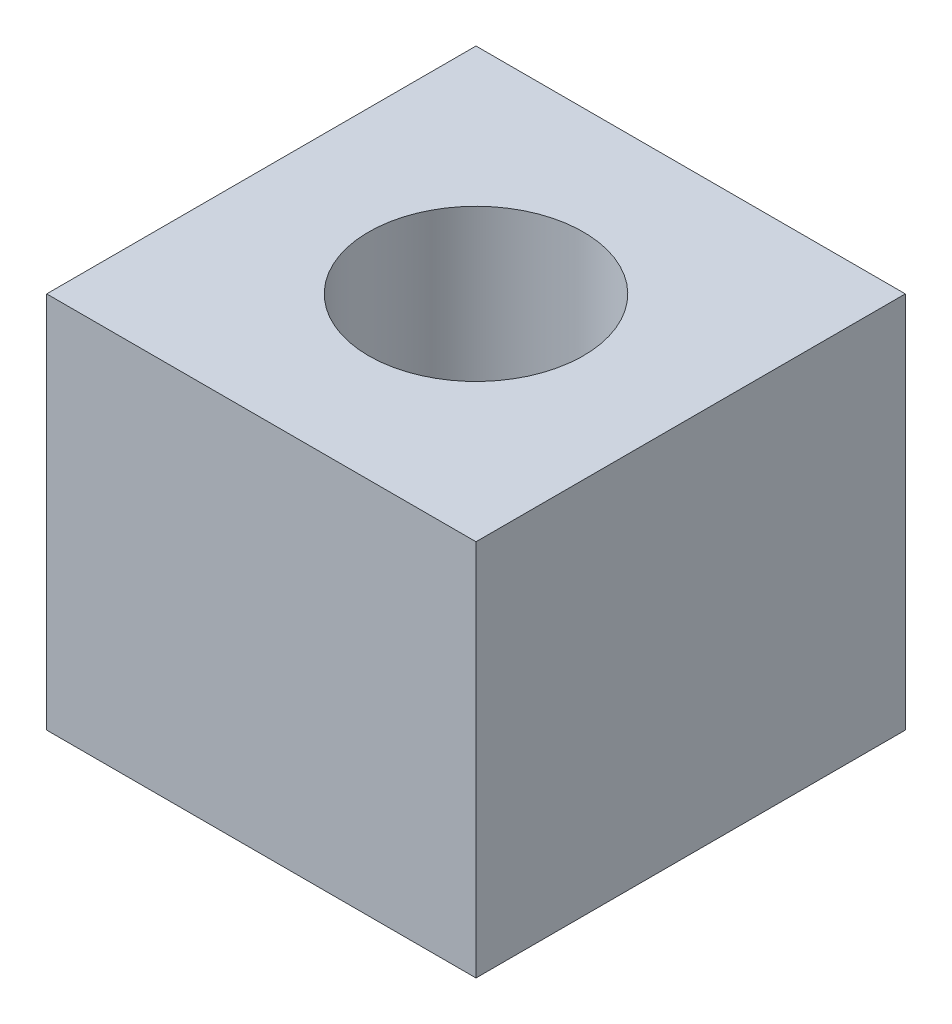
ISO-10303-21;
HEADER;
FILE_DESCRIPTION(('STEP AP214'),'2;1');
FILE_NAME('part.step','',(''),(''),'','','');
FILE_SCHEMA(('AUTOMOTIVE_DESIGN { 1 0 10303 214 1 1 1 1 }'));
ENDSEC;
DATA;
#1=APPLICATION_CONTEXT('core data for automotive mechanical design processes');
#2=APPLICATION_PROTOCOL_DEFINITION('international standard','automotive_design',2000,#1);
#3=PRODUCT_CONTEXT('',#1,'mechanical');
#4=PRODUCT('Part','Part','',(#3));
#5=PRODUCT_RELATED_PRODUCT_CATEGORY('part','',(#4));
#6=PRODUCT_DEFINITION_FORMATION('','',#4);
#7=PRODUCT_DEFINITION_CONTEXT('part definition',#1,'design');
#8=PRODUCT_DEFINITION('design','',#6,#7);
#9=PRODUCT_DEFINITION_SHAPE('','',#8);
#10=(LENGTH_UNIT() NAMED_UNIT(*) SI_UNIT(.MILLI.,.METRE.));
#11=(NAMED_UNIT(*) PLANE_ANGLE_UNIT() SI_UNIT($,.RADIAN.));
#12=(NAMED_UNIT(*) SI_UNIT($,.STERADIAN.) SOLID_ANGLE_UNIT());
#13=UNCERTAINTY_MEASURE_WITH_UNIT(LENGTH_MEASURE(1.E-05),#10,'distance_accuracy_value','');
#14=(GEOMETRIC_REPRESENTATION_CONTEXT(3) GLOBAL_UNCERTAINTY_ASSIGNED_CONTEXT((#13)) GLOBAL_UNIT_ASSIGNED_CONTEXT((#10,
#11,#12)) REPRESENTATION_CONTEXT('',''));
#15=CARTESIAN_POINT('',(0.,0.,0.));
#16=DIRECTION('',(0.,0.,1.));
#17=DIRECTION('',(1.,0.,0.));
#18=AXIS2_PLACEMENT_3D('',#15,#16,#17);
#19=CARTESIAN_POINT('',(-12.7,22.352,12.7));
#20=DIRECTION('',(1.,0.,0.));
#21=DIRECTION('',(0.,0.,-1.));
#22=AXIS2_PLACEMENT_3D('',#19,#20,#21);
#23=PLANE('',#22);
#24=DIRECTION('',(0.,0.,1.));
#25=VECTOR('',#24,1.);
#26=CARTESIAN_POINT('',(-12.7,0.,12.7));
#27=LINE('',#26,#25);
#28=CARTESIAN_POINT('',(-12.7,0.,-12.7));
#29=VERTEX_POINT('',#28);
#30=CARTESIAN_POINT('',(-12.7,0.,12.7));
#31=VERTEX_POINT('',#30);
#32=EDGE_CURVE('E99',#29,#31,#27,.T.);
#33=ORIENTED_EDGE('',*,*,#32,.T.);
#34=DIRECTION('',(0.,-1.,0.));
#35=VECTOR('',#34,1.);
#36=CARTESIAN_POINT('',(-12.7,22.352,12.7));
#37=LINE('',#36,#35);
#38=CARTESIAN_POINT('',(-12.7,22.352,12.7));
#39=VERTEX_POINT('',#38);
#40=EDGE_CURVE('E11',#39,#31,#37,.T.);
#41=ORIENTED_EDGE('',*,*,#40,.F.);
#42=DIRECTION('',(0.,0.,1.));
#43=VECTOR('',#42,1.);
#44=CARTESIAN_POINT('',(-12.7,22.352,12.7));
#45=LINE('',#44,#43);
#46=CARTESIAN_POINT('',(-12.7,22.352,-12.7));
#47=VERTEX_POINT('',#46);
#48=EDGE_CURVE('E86',#47,#39,#45,.T.);
#49=ORIENTED_EDGE('',*,*,#48,.F.);
#50=DIRECTION('',(0.,-1.,0.));
#51=VECTOR('',#50,1.);
#52=CARTESIAN_POINT('',(-12.7,22.352,-12.7));
#53=LINE('',#52,#51);
#54=EDGE_CURVE('E95',#47,#29,#53,.T.);
#55=ORIENTED_EDGE('',*,*,#54,.T.);
#56=EDGE_LOOP('',(#33,#41,#49,#55));
#57=FACE_BOUND('',#56,.T.);
#58=ADVANCED_FACE('F34',(#57),#23,.F.);
#59=CARTESIAN_POINT('',(12.7,22.352,12.7));
#60=DIRECTION('',(0.,0.,-1.));
#61=DIRECTION('',(-1.,0.,0.));
#62=AXIS2_PLACEMENT_3D('',#59,#60,#61);
#63=PLANE('',#62);
#64=DIRECTION('',(1.,0.,0.));
#65=VECTOR('',#64,1.);
#66=CARTESIAN_POINT('',(12.7,0.,12.7));
#67=LINE('',#66,#65);
#68=CARTESIAN_POINT('',(12.7,0.,12.7));
#69=VERTEX_POINT('',#68);
#70=EDGE_CURVE('E90',#31,#69,#67,.T.);
#71=ORIENTED_EDGE('',*,*,#70,.T.);
#72=DIRECTION('',(0.,-1.,0.));
#73=VECTOR('',#72,1.);
#74=CARTESIAN_POINT('',(12.7,22.352,12.7));
#75=LINE('',#74,#73);
#76=CARTESIAN_POINT('',(12.7,22.352,12.7));
#77=VERTEX_POINT('',#76);
#78=EDGE_CURVE('E43',#77,#69,#75,.T.);
#79=ORIENTED_EDGE('',*,*,#78,.F.);
#80=DIRECTION('',(1.,0.,0.));
#81=VECTOR('',#80,1.);
#82=CARTESIAN_POINT('',(12.7,22.352,12.7));
#83=LINE('',#82,#81);
#84=EDGE_CURVE('E81',#39,#77,#83,.T.);
#85=ORIENTED_EDGE('',*,*,#84,.F.);
#86=ORIENTED_EDGE('',*,*,#40,.T.);
#87=EDGE_LOOP('',(#71,#79,#85,#86));
#88=FACE_BOUND('',#87,.T.);
#89=ADVANCED_FACE('F89',(#88),#63,.F.);
#90=CARTESIAN_POINT('',(12.7,22.352,12.7));
#91=DIRECTION('',(-1.,0.,0.));
#92=DIRECTION('',(0.,0.,1.));
#93=AXIS2_PLACEMENT_3D('',#90,#91,#92);
#94=PLANE('',#93);
#95=DIRECTION('',(0.,0.,-1.));
#96=VECTOR('',#95,1.);
#97=CARTESIAN_POINT('',(12.7,0.,12.7));
#98=LINE('',#97,#96);
#99=CARTESIAN_POINT('',(12.7,0.,-12.7));
#100=VERTEX_POINT('',#99);
#101=EDGE_CURVE('E68',#69,#100,#98,.T.);
#102=ORIENTED_EDGE('',*,*,#101,.T.);
#103=DIRECTION('',(0.,-1.,0.));
#104=VECTOR('',#103,1.);
#105=CARTESIAN_POINT('',(12.7,22.352,-12.7));
#106=LINE('',#105,#104);
#107=CARTESIAN_POINT('',(12.7,22.352,-12.7));
#108=VERTEX_POINT('',#107);
#109=EDGE_CURVE('E91',#108,#100,#106,.T.);
#110=ORIENTED_EDGE('',*,*,#109,.F.);
#111=DIRECTION('',(0.,0.,-1.));
#112=VECTOR('',#111,1.);
#113=CARTESIAN_POINT('',(12.7,22.352,12.7));
#114=LINE('',#113,#112);
#115=EDGE_CURVE('E84',#77,#108,#114,.T.);
#116=ORIENTED_EDGE('',*,*,#115,.F.);
#117=ORIENTED_EDGE('',*,*,#78,.T.);
#118=EDGE_LOOP('',(#102,#110,#116,#117));
#119=FACE_BOUND('',#118,.T.);
#120=ADVANCED_FACE('F93',(#119),#94,.F.);
#121=CARTESIAN_POINT('',(12.7,22.352,-12.7));
#122=DIRECTION('',(0.,0.,1.));
#123=DIRECTION('',(1.,0.,0.));
#124=AXIS2_PLACEMENT_3D('',#121,#122,#123);
#125=PLANE('',#124);
#126=DIRECTION('',(-1.,0.,0.));
#127=VECTOR('',#126,1.);
#128=CARTESIAN_POINT('',(12.7,0.,-12.7));
#129=LINE('',#128,#127);
#130=EDGE_CURVE('E74',#100,#29,#129,.T.);
#131=ORIENTED_EDGE('',*,*,#130,.T.);
#132=ORIENTED_EDGE('',*,*,#54,.F.);
#133=DIRECTION('',(-1.,0.,0.));
#134=VECTOR('',#133,1.);
#135=CARTESIAN_POINT('',(12.7,22.352,-12.7));
#136=LINE('',#135,#134);
#137=EDGE_CURVE('E51',#108,#47,#136,.T.);
#138=ORIENTED_EDGE('',*,*,#137,.F.);
#139=ORIENTED_EDGE('',*,*,#109,.T.);
#140=EDGE_LOOP('',(#131,#132,#138,#139));
#141=FACE_BOUND('',#140,.T.);
#142=ADVANCED_FACE('F106',(#141),#125,.F.);
#143=CARTESIAN_POINT('',(0.,22.352,0.));
#144=DIRECTION('',(0.,1.,0.));
#145=DIRECTION('',(0.,0.,1.));
#146=AXIS2_PLACEMENT_3D('',#143,#144,#145);
#147=PLANE('',#146);
#148=CARTESIAN_POINT('',(0.,22.352,0.));
#149=DIRECTION('',(0.,1.,0.));
#150=DIRECTION('',(0.,0.,1.));
#151=AXIS2_PLACEMENT_3D('',#148,#149,#150);
#152=CIRCLE('',#151,6.35);
#153=CARTESIAN_POINT('',(0.,22.352,6.35));
#154=VERTEX_POINT('',#153);
#155=EDGE_CURVE('E112',#154,#154,#152,.T.);
#156=ORIENTED_EDGE('',*,*,#155,.F.);
#157=EDGE_LOOP('',(#156));
#158=FACE_BOUND('',#157,.T.);
#159=ORIENTED_EDGE('',*,*,#48,.T.);
#160=ORIENTED_EDGE('',*,*,#84,.T.);
#161=ORIENTED_EDGE('',*,*,#115,.T.);
#162=ORIENTED_EDGE('',*,*,#137,.T.);
#163=EDGE_LOOP('',(#159,#160,#161,#162));
#164=FACE_BOUND('',#163,.T.);
#165=ADVANCED_FACE('F82',(#158,#164),#147,.T.);
#166=CARTESIAN_POINT('',(0.,0.,0.));
#167=DIRECTION('',(0.,1.,0.));
#168=DIRECTION('',(0.,0.,1.));
#169=AXIS2_PLACEMENT_3D('',#166,#167,#168);
#170=PLANE('',#169);
#171=CARTESIAN_POINT('',(0.,0.,0.));
#172=DIRECTION('',(0.,1.,0.));
#173=DIRECTION('',(0.,0.,1.));
#174=AXIS2_PLACEMENT_3D('',#171,#172,#173);
#175=CIRCLE('',#174,6.35);
#176=CARTESIAN_POINT('',(0.,0.,6.35));
#177=VERTEX_POINT('',#176);
#178=EDGE_CURVE('E37',#177,#177,#175,.T.);
#179=ORIENTED_EDGE('',*,*,#178,.T.);
#180=EDGE_LOOP('',(#179));
#181=FACE_BOUND('',#180,.T.);
#182=ORIENTED_EDGE('',*,*,#32,.F.);
#183=ORIENTED_EDGE('',*,*,#130,.F.);
#184=ORIENTED_EDGE('',*,*,#101,.F.);
#185=ORIENTED_EDGE('',*,*,#70,.F.);
#186=EDGE_LOOP('',(#182,#183,#184,#185));
#187=FACE_BOUND('',#186,.T.);
#188=ADVANCED_FACE('F109',(#181,#187),#170,.F.);
#189=CARTESIAN_POINT('',(0.,-3.048,0.));
#190=DIRECTION('',(0.,1.,0.));
#191=DIRECTION('',(0.,0.,1.));
#192=AXIS2_PLACEMENT_3D('',#189,#190,#191);
#193=CYLINDRICAL_SURFACE('',#192,6.35);
#194=ORIENTED_EDGE('',*,*,#155,.T.);
#195=EDGE_LOOP('',(#194));
#196=FACE_BOUND('',#195,.T.);
#197=ORIENTED_EDGE('',*,*,#178,.F.);
#198=EDGE_LOOP('',(#197));
#199=FACE_BOUND('',#198,.T.);
#200=ADVANCED_FACE('F120',(#196,#199),#193,.F.);
#201=CLOSED_SHELL('',(#58,#89,#120,#142,#165,#188,#200));
#202=MANIFOLD_SOLID_BREP('B2',#201);
#203=ADVANCED_BREP_SHAPE_REPRESENTATION('',(#18,#202),#14);
#204=SHAPE_DEFINITION_REPRESENTATION(#9,#203);
ENDSEC;
END-ISO-10303-21;
